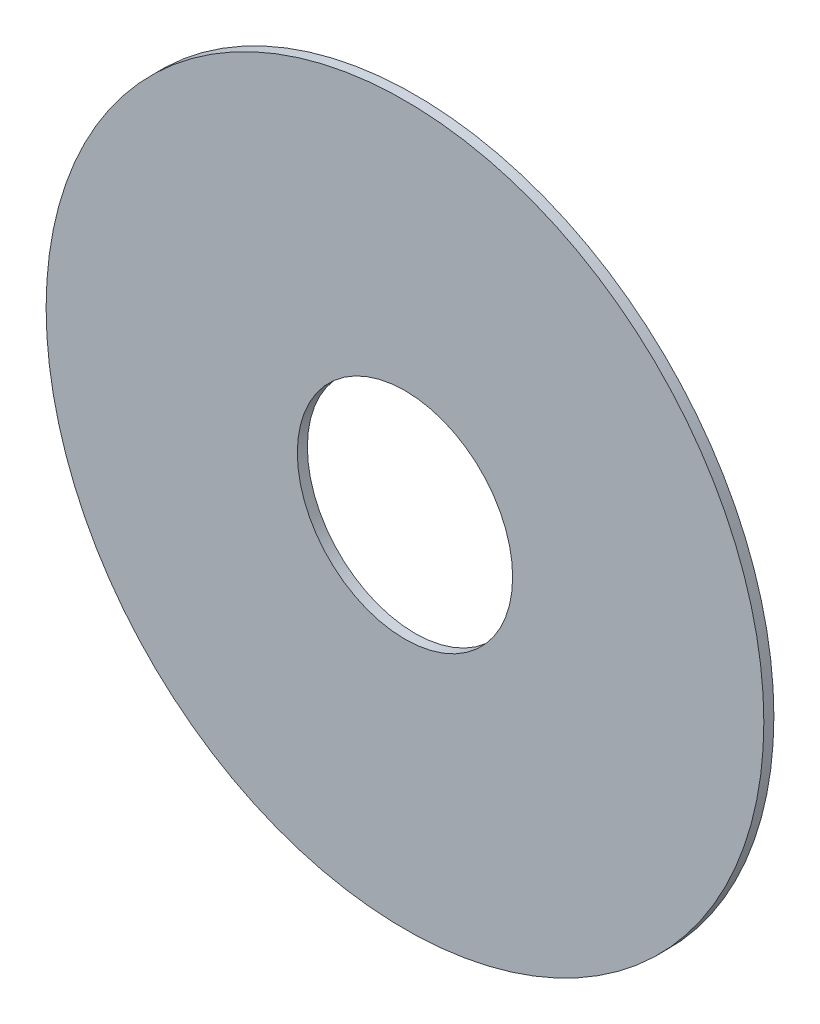
ISO-10303-21;
HEADER;
FILE_DESCRIPTION(('STEP AP214'),'2;1');
FILE_NAME('part.step','',(''),(''),'','','');
FILE_SCHEMA(('AUTOMOTIVE_DESIGN { 1 0 10303 214 1 1 1 1 }'));
ENDSEC;
DATA;
#1=APPLICATION_CONTEXT('core data for automotive mechanical design processes');
#2=APPLICATION_PROTOCOL_DEFINITION('international standard','automotive_design',2000,#1);
#3=PRODUCT_CONTEXT('',#1,'mechanical');
#4=PRODUCT('Part','Part','',(#3));
#5=PRODUCT_RELATED_PRODUCT_CATEGORY('part','',(#4));
#6=PRODUCT_DEFINITION_FORMATION('','',#4);
#7=PRODUCT_DEFINITION_CONTEXT('part definition',#1,'design');
#8=PRODUCT_DEFINITION('design','',#6,#7);
#9=PRODUCT_DEFINITION_SHAPE('','',#8);
#10=(LENGTH_UNIT() NAMED_UNIT(*) SI_UNIT(.MILLI.,.METRE.));
#11=(NAMED_UNIT(*) PLANE_ANGLE_UNIT() SI_UNIT($,.RADIAN.));
#12=(NAMED_UNIT(*) SI_UNIT($,.STERADIAN.) SOLID_ANGLE_UNIT());
#13=UNCERTAINTY_MEASURE_WITH_UNIT(LENGTH_MEASURE(1.E-05),#10,'distance_accuracy_value','');
#14=(GEOMETRIC_REPRESENTATION_CONTEXT(3) GLOBAL_UNCERTAINTY_ASSIGNED_CONTEXT((#13)) GLOBAL_UNIT_ASSIGNED_CONTEXT((#10,
#11,#12)) REPRESENTATION_CONTEXT('',''));
#15=CARTESIAN_POINT('',(0.,0.,0.));
#16=DIRECTION('',(0.,0.,1.));
#17=DIRECTION('',(1.,0.,0.));
#18=AXIS2_PLACEMENT_3D('',#15,#16,#17);
#19=CARTESIAN_POINT('',(176.276,-95.504,-0.045));
#20=DIRECTION('',(0.,0.,-1.));
#21=DIRECTION('',(0.,-1.,0.));
#22=AXIS2_PLACEMENT_3D('',#19,#20,#21);
#23=CYLINDRICAL_SURFACE('',#22,0.375);
#24=CARTESIAN_POINT('',(176.276,-95.504,-0.035));
#25=DIRECTION('',(0.,0.,-1.));
#26=DIRECTION('',(0.,-1.,0.));
#27=AXIS2_PLACEMENT_3D('',#24,#25,#26);
#28=CIRCLE('',#27,0.375);
#29=CARTESIAN_POINT('',(176.276,-95.879,-0.035));
#30=VERTEX_POINT('',#29);
#31=EDGE_CURVE('E26',#30,#30,#28,.T.);
#32=ORIENTED_EDGE('',*,*,#31,.T.);
#33=DIRECTION('',(0.,0.,1.));
#34=VECTOR('',#33,1.);
#35=CARTESIAN_POINT('',(176.276,-95.879,-0.045));
#36=LINE('',#35,#34);
#37=CARTESIAN_POINT('',(176.276,-95.879,0.));
#38=VERTEX_POINT('',#37);
#39=EDGE_CURVE('E11',#30,#38,#36,.T.);
#40=ORIENTED_EDGE('',*,*,#39,.T.);
#41=CARTESIAN_POINT('',(176.276,-95.504,0.));
#42=DIRECTION('',(0.,0.,-1.));
#43=DIRECTION('',(0.,-1.,0.));
#44=AXIS2_PLACEMENT_3D('',#41,#42,#43);
#45=CIRCLE('',#44,0.375);
#46=EDGE_CURVE('E70',#38,#38,#45,.T.);
#47=ORIENTED_EDGE('',*,*,#46,.F.);
#48=ORIENTED_EDGE('',*,*,#39,.F.);
#49=EDGE_LOOP('',(#32,#40,#47,#48));
#50=FACE_BOUND('',#49,.T.);
#51=ADVANCED_FACE('F17',(#50),#23,.F.);
#52=CARTESIAN_POINT('',(176.276,-95.504,-0.035));
#53=DIRECTION('',(0.,0.,1.));
#54=DIRECTION('',(1.,0.,0.));
#55=AXIS2_PLACEMENT_3D('',#52,#53,#54);
#56=PLANE('',#55);
#57=ORIENTED_EDGE('',*,*,#31,.F.);
#58=EDGE_LOOP('',(#57));
#59=FACE_BOUND('',#58,.T.);
#60=CARTESIAN_POINT('',(176.276,-95.504,-0.035));
#61=DIRECTION('',(0.,0.,1.));
#62=DIRECTION('',(1.,0.,0.));
#63=AXIS2_PLACEMENT_3D('',#60,#61,#62);
#64=CIRCLE('',#63,1.25);
#65=CARTESIAN_POINT('',(177.526,-95.504,-0.035));
#66=VERTEX_POINT('',#65);
#67=EDGE_CURVE('E57',#66,#66,#64,.T.);
#68=ORIENTED_EDGE('',*,*,#67,.F.);
#69=EDGE_LOOP('',(#68));
#70=FACE_BOUND('',#69,.T.);
#71=ADVANCED_FACE('F19',(#59,#70),#56,.F.);
#72=CARTESIAN_POINT('',(176.276,-95.504,0.));
#73=DIRECTION('',(0.,0.,1.));
#74=DIRECTION('',(1.,0.,0.));
#75=AXIS2_PLACEMENT_3D('',#72,#73,#74);
#76=PLANE('',#75);
#77=ORIENTED_EDGE('',*,*,#46,.T.);
#78=EDGE_LOOP('',(#77));
#79=FACE_BOUND('',#78,.T.);
#80=CARTESIAN_POINT('',(176.276,-95.504,0.));
#81=DIRECTION('',(0.,0.,1.));
#82=DIRECTION('',(1.,0.,0.));
#83=AXIS2_PLACEMENT_3D('',#80,#81,#82);
#84=CIRCLE('',#83,1.25);
#85=CARTESIAN_POINT('',(177.526,-95.504,0.));
#86=VERTEX_POINT('',#85);
#87=EDGE_CURVE('E55',#86,#86,#84,.T.);
#88=ORIENTED_EDGE('',*,*,#87,.T.);
#89=EDGE_LOOP('',(#88));
#90=FACE_BOUND('',#89,.T.);
#91=ADVANCED_FACE('F61',(#79,#90),#76,.T.);
#92=CARTESIAN_POINT('',(176.276,-95.504,-0.035));
#93=DIRECTION('',(0.,0.,1.));
#94=DIRECTION('',(1.,0.,0.));
#95=AXIS2_PLACEMENT_3D('',#92,#93,#94);
#96=CYLINDRICAL_SURFACE('',#95,1.25);
#97=ORIENTED_EDGE('',*,*,#87,.F.);
#98=DIRECTION('',(0.,0.,1.));
#99=VECTOR('',#98,1.);
#100=CARTESIAN_POINT('',(177.526,-95.504,-0.035));
#101=LINE('',#100,#99);
#102=EDGE_CURVE('E52',#66,#86,#101,.T.);
#103=ORIENTED_EDGE('',*,*,#102,.F.);
#104=ORIENTED_EDGE('',*,*,#67,.T.);
#105=ORIENTED_EDGE('',*,*,#102,.T.);
#106=EDGE_LOOP('',(#97,#103,#104,#105));
#107=FACE_BOUND('',#106,.T.);
#108=ADVANCED_FACE('F54',(#107),#96,.T.);
#109=CLOSED_SHELL('',(#51,#71,#91,#108));
#110=MANIFOLD_SOLID_BREP('B1',#109);
#111=ADVANCED_BREP_SHAPE_REPRESENTATION('',(#18,#110),#14);
#112=SHAPE_DEFINITION_REPRESENTATION(#9,#111);
ENDSEC;
END-ISO-10303-21;
